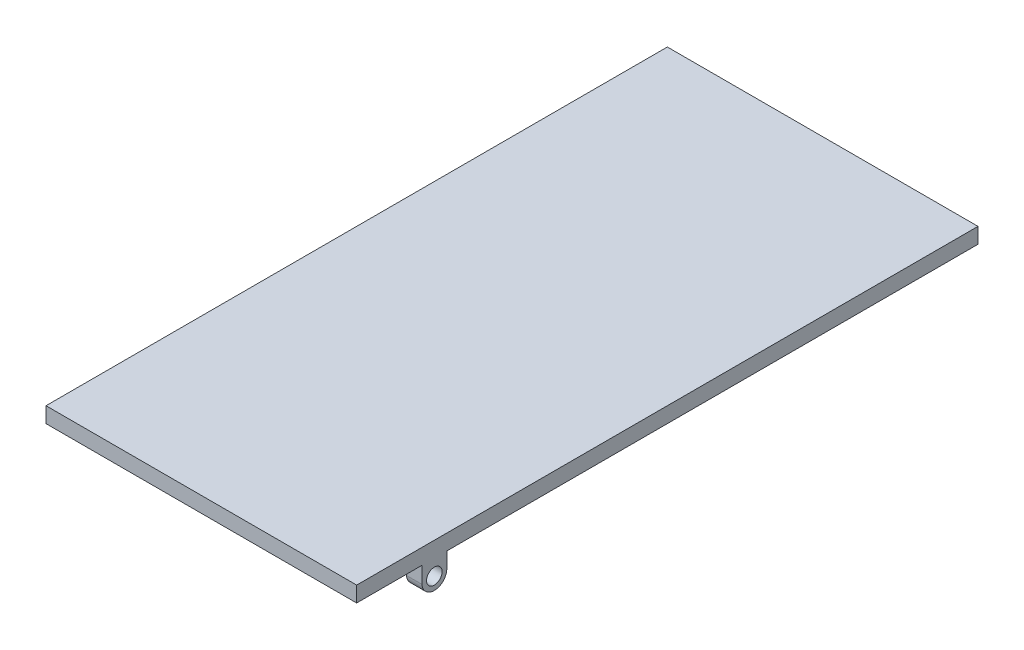
ISO-10303-21;
HEADER;
FILE_DESCRIPTION(('STEP AP214'),'2;1');
FILE_NAME('part.step','',(''),(''),'','','');
FILE_SCHEMA(('AUTOMOTIVE_DESIGN { 1 0 10303 214 1 1 1 1 }'));
ENDSEC;
DATA;
#1=APPLICATION_CONTEXT('core data for automotive mechanical design processes');
#2=APPLICATION_PROTOCOL_DEFINITION('international standard','automotive_design',2000,#1);
#3=PRODUCT_CONTEXT('',#1,'mechanical');
#4=PRODUCT('Part','Part','',(#3));
#5=PRODUCT_RELATED_PRODUCT_CATEGORY('part','',(#4));
#6=PRODUCT_DEFINITION_FORMATION('','',#4);
#7=PRODUCT_DEFINITION_CONTEXT('part definition',#1,'design');
#8=PRODUCT_DEFINITION('design','',#6,#7);
#9=PRODUCT_DEFINITION_SHAPE('','',#8);
#10=(LENGTH_UNIT() NAMED_UNIT(*) SI_UNIT(.MILLI.,.METRE.));
#11=(NAMED_UNIT(*) PLANE_ANGLE_UNIT() SI_UNIT($,.RADIAN.));
#12=(NAMED_UNIT(*) SI_UNIT($,.STERADIAN.) SOLID_ANGLE_UNIT());
#13=UNCERTAINTY_MEASURE_WITH_UNIT(LENGTH_MEASURE(1.E-05),#10,'distance_accuracy_value','');
#14=(GEOMETRIC_REPRESENTATION_CONTEXT(3) GLOBAL_UNCERTAINTY_ASSIGNED_CONTEXT((#13)) GLOBAL_UNIT_ASSIGNED_CONTEXT((#10,
#11,#12)) REPRESENTATION_CONTEXT('',''));
#15=CARTESIAN_POINT('',(0.,0.,0.));
#16=DIRECTION('',(0.,0.,1.));
#17=DIRECTION('',(1.,0.,0.));
#18=AXIS2_PLACEMENT_3D('',#15,#16,#17);
#19=CARTESIAN_POINT('',(0.,0.,342.));
#20=DIRECTION('',(0.,0.,1.));
#21=DIRECTION('',(1.,0.,0.));
#22=AXIS2_PLACEMENT_3D('',#19,#20,#21);
#23=PLANE('',#22);
#24=DIRECTION('',(0.,1.,0.));
#25=VECTOR('',#24,1.);
#26=CARTESIAN_POINT('',(10.,-75.,342.));
#27=LINE('',#26,#25);
#28=CARTESIAN_POINT('',(10.,-10.5969151687009,342.));
#29=VERTEX_POINT('',#28);
#30=CARTESIAN_POINT('',(10.,0.,342.));
#31=VERTEX_POINT('',#30);
#32=EDGE_CURVE('E125',#29,#31,#27,.T.);
#33=ORIENTED_EDGE('',*,*,#32,.F.);
#34=DIRECTION('',(1.,0.,0.));
#35=VECTOR('',#34,1.);
#36=CARTESIAN_POINT('',(0.,-10.5969151687009,342.));
#37=LINE('',#36,#35);
#38=CARTESIAN_POINT('',(0.,-10.5969151687009,342.));
#39=VERTEX_POINT('',#38);
#40=EDGE_CURVE('E169',#39,#29,#37,.T.);
#41=ORIENTED_EDGE('',*,*,#40,.F.);
#42=DIRECTION('',(0.,-1.,0.));
#43=VECTOR('',#42,1.);
#44=CARTESIAN_POINT('',(0.,0.,342.));
#45=LINE('',#44,#43);
#46=CARTESIAN_POINT('',(0.,0.,342.));
#47=VERTEX_POINT('',#46);
#48=EDGE_CURVE('E147',#47,#39,#45,.T.);
#49=ORIENTED_EDGE('',*,*,#48,.F.);
#50=DIRECTION('',(1.,0.,0.));
#51=VECTOR('',#50,1.);
#52=CARTESIAN_POINT('',(0.,0.,342.));
#53=LINE('',#52,#51);
#54=EDGE_CURVE('E143',#47,#31,#53,.T.);
#55=ORIENTED_EDGE('',*,*,#54,.T.);
#56=EDGE_LOOP('',(#33,#41,#49,#55));
#57=FACE_BOUND('',#56,.T.);
#58=ADVANCED_FACE('F35',(#57),#23,.F.);
#59=DIRECTION('',(0.,1.,0.));
#60=VECTOR('',#59,1.);
#61=CARTESIAN_POINT('',(190.,-75.,342.));
#62=LINE('',#61,#60);
#63=CARTESIAN_POINT('',(190.,-10.5969151687009,342.));
#64=VERTEX_POINT('',#63);
#65=CARTESIAN_POINT('',(190.,0.,342.));
#66=VERTEX_POINT('',#65);
#67=EDGE_CURVE('E138',#64,#66,#62,.T.);
#68=ORIENTED_EDGE('',*,*,#67,.T.);
#69=CARTESIAN_POINT('',(200.,0.,342.));
#70=VERTEX_POINT('',#69);
#71=EDGE_CURVE('E148',#66,#70,#53,.T.);
#72=ORIENTED_EDGE('',*,*,#71,.T.);
#73=DIRECTION('',(0.,-1.,0.));
#74=VECTOR('',#73,1.);
#75=CARTESIAN_POINT('',(200.,0.,342.));
#76=LINE('',#75,#74);
#77=CARTESIAN_POINT('',(200.,-10.5969151687009,342.));
#78=VERTEX_POINT('',#77);
#79=EDGE_CURVE('E209',#70,#78,#76,.T.);
#80=ORIENTED_EDGE('',*,*,#79,.T.);
#81=EDGE_CURVE('E217',#64,#78,#37,.T.);
#82=ORIENTED_EDGE('',*,*,#81,.F.);
#83=EDGE_LOOP('',(#68,#72,#80,#82));
#84=FACE_BOUND('',#83,.T.);
#85=ADVANCED_FACE('F235',(#84),#23,.F.);
#86=CARTESIAN_POINT('',(0.,-10.,350.));
#87=DIRECTION('',(1.,0.,0.));
#88=DIRECTION('',(0.,0.,-1.));
#89=AXIS2_PLACEMENT_3D('',#86,#87,#88);
#90=CYLINDRICAL_SURFACE('',#89,8.02223832347465);
#91=ORIENTED_EDGE('',*,*,#40,.T.);
#92=CARTESIAN_POINT('',(10.,-10.,350.));
#93=DIRECTION('',(1.,0.,0.));
#94=DIRECTION('',(0.,0.,-1.));
#95=AXIS2_PLACEMENT_3D('',#92,#93,#94);
#96=CIRCLE('',#95,8.02223832347465);
#97=CARTESIAN_POINT('',(10.,-10.5969151687009,358.));
#98=VERTEX_POINT('',#97);
#99=EDGE_CURVE('E132',#29,#98,#96,.F.);
#100=ORIENTED_EDGE('',*,*,#99,.T.);
#101=DIRECTION('',(1.,0.,0.));
#102=VECTOR('',#101,1.);
#103=CARTESIAN_POINT('',(0.,-10.5969151687009,358.));
#104=LINE('',#103,#102);
#105=CARTESIAN_POINT('',(0.,-10.5969151687009,358.));
#106=VERTEX_POINT('',#105);
#107=EDGE_CURVE('E218',#106,#98,#104,.T.);
#108=ORIENTED_EDGE('',*,*,#107,.F.);
#109=CARTESIAN_POINT('',(0.,-10.,350.));
#110=DIRECTION('',(1.,0.,0.));
#111=DIRECTION('',(0.,0.,-1.));
#112=AXIS2_PLACEMENT_3D('',#109,#110,#111);
#113=CIRCLE('',#112,8.02223832347465);
#114=EDGE_CURVE('E151',#106,#39,#113,.T.);
#115=ORIENTED_EDGE('',*,*,#114,.T.);
#116=EDGE_LOOP('',(#91,#100,#108,#115));
#117=FACE_BOUND('',#116,.T.);
#118=ADVANCED_FACE('F274',(#117),#90,.T.);
#119=CARTESIAN_POINT('',(190.,-10.5969151687009,358.));
#120=VERTEX_POINT('',#119);
#121=CARTESIAN_POINT('',(200.,-10.5969151687009,358.));
#122=VERTEX_POINT('',#121);
#123=EDGE_CURVE('E220',#120,#122,#104,.T.);
#124=ORIENTED_EDGE('',*,*,#123,.F.);
#125=CARTESIAN_POINT('',(190.,-10.,350.));
#126=DIRECTION('',(-1.,0.,0.));
#127=DIRECTION('',(0.,0.,1.));
#128=AXIS2_PLACEMENT_3D('',#125,#126,#127);
#129=CIRCLE('',#128,8.02223832347465);
#130=EDGE_CURVE('E184',#120,#64,#129,.F.);
#131=ORIENTED_EDGE('',*,*,#130,.T.);
#132=ORIENTED_EDGE('',*,*,#81,.T.);
#133=CARTESIAN_POINT('',(200.,-10.,350.));
#134=DIRECTION('',(1.,0.,0.));
#135=DIRECTION('',(0.,0.,-1.));
#136=AXIS2_PLACEMENT_3D('',#133,#134,#135);
#137=CIRCLE('',#136,8.02223832347465);
#138=EDGE_CURVE('E200',#122,#78,#137,.T.);
#139=ORIENTED_EDGE('',*,*,#138,.F.);
#140=EDGE_LOOP('',(#124,#131,#132,#139));
#141=FACE_BOUND('',#140,.T.);
#142=ADVANCED_FACE('F232',(#141),#90,.T.);
#143=CARTESIAN_POINT('',(0.,0.,358.));
#144=DIRECTION('',(0.,0.,1.));
#145=DIRECTION('',(1.,0.,0.));
#146=AXIS2_PLACEMENT_3D('',#143,#144,#145);
#147=PLANE('',#146);
#148=ORIENTED_EDGE('',*,*,#107,.T.);
#149=DIRECTION('',(0.,1.,0.));
#150=VECTOR('',#149,1.);
#151=CARTESIAN_POINT('',(10.,-75.,358.));
#152=LINE('',#151,#150);
#153=CARTESIAN_POINT('',(10.,0.,358.));
#154=VERTEX_POINT('',#153);
#155=EDGE_CURVE('E257',#98,#154,#152,.T.);
#156=ORIENTED_EDGE('',*,*,#155,.T.);
#157=DIRECTION('',(1.,0.,0.));
#158=VECTOR('',#157,1.);
#159=CARTESIAN_POINT('',(0.,0.,358.));
#160=LINE('',#159,#158);
#161=CARTESIAN_POINT('',(0.,0.,358.));
#162=VERTEX_POINT('',#161);
#163=EDGE_CURVE('E145',#162,#154,#160,.T.);
#164=ORIENTED_EDGE('',*,*,#163,.F.);
#165=DIRECTION('',(0.,-1.,0.));
#166=VECTOR('',#165,1.);
#167=CARTESIAN_POINT('',(0.,0.,358.));
#168=LINE('',#167,#166);
#169=EDGE_CURVE('E202',#162,#106,#168,.T.);
#170=ORIENTED_EDGE('',*,*,#169,.T.);
#171=EDGE_LOOP('',(#148,#156,#164,#170));
#172=FACE_BOUND('',#171,.T.);
#173=ADVANCED_FACE('F256',(#172),#147,.T.);
#174=CARTESIAN_POINT('',(190.,0.,358.));
#175=VERTEX_POINT('',#174);
#176=CARTESIAN_POINT('',(200.,0.,358.));
#177=VERTEX_POINT('',#176);
#178=EDGE_CURVE('E57',#175,#177,#160,.T.);
#179=ORIENTED_EDGE('',*,*,#178,.F.);
#180=DIRECTION('',(0.,1.,0.));
#181=VECTOR('',#180,1.);
#182=CARTESIAN_POINT('',(190.,-75.,358.));
#183=LINE('',#182,#181);
#184=EDGE_CURVE('E225',#120,#175,#183,.T.);
#185=ORIENTED_EDGE('',*,*,#184,.F.);
#186=ORIENTED_EDGE('',*,*,#123,.T.);
#187=DIRECTION('',(0.,-1.,0.));
#188=VECTOR('',#187,1.);
#189=CARTESIAN_POINT('',(200.,0.,358.));
#190=LINE('',#189,#188);
#191=EDGE_CURVE('E212',#177,#122,#190,.T.);
#192=ORIENTED_EDGE('',*,*,#191,.F.);
#193=EDGE_LOOP('',(#179,#185,#186,#192));
#194=FACE_BOUND('',#193,.T.);
#195=ADVANCED_FACE('F224',(#194),#147,.T.);
#196=CARTESIAN_POINT('',(0.,-10.,350.));
#197=DIRECTION('',(1.,0.,0.));
#198=DIRECTION('',(0.,0.,-1.));
#199=AXIS2_PLACEMENT_3D('',#196,#197,#198);
#200=CYLINDRICAL_SURFACE('',#199,4.99999999999999);
#201=CARTESIAN_POINT('',(0.,-10.,350.));
#202=DIRECTION('',(1.,0.,0.));
#203=DIRECTION('',(0.,0.,-1.));
#204=AXIS2_PLACEMENT_3D('',#201,#202,#203);
#205=CIRCLE('',#204,4.99999999999999);
#206=CARTESIAN_POINT('',(0.,-10.,345.));
#207=VERTEX_POINT('',#206);
#208=EDGE_CURVE('E197',#207,#207,#205,.T.);
#209=ORIENTED_EDGE('',*,*,#208,.F.);
#210=EDGE_LOOP('',(#209));
#211=FACE_BOUND('',#210,.T.);
#212=CARTESIAN_POINT('',(10.,-10.,350.));
#213=DIRECTION('',(1.,0.,0.));
#214=DIRECTION('',(0.,0.,-1.));
#215=AXIS2_PLACEMENT_3D('',#212,#213,#214);
#216=CIRCLE('',#215,4.99999999999999);
#217=CARTESIAN_POINT('',(10.,-10.,345.));
#218=VERTEX_POINT('',#217);
#219=EDGE_CURVE('E39',#218,#218,#216,.F.);
#220=ORIENTED_EDGE('',*,*,#219,.F.);
#221=EDGE_LOOP('',(#220));
#222=FACE_BOUND('',#221,.T.);
#223=ADVANCED_FACE('F278',(#211,#222),#200,.F.);
#224=CARTESIAN_POINT('',(200.,-10.,350.));
#225=DIRECTION('',(1.,0.,0.));
#226=DIRECTION('',(0.,0.,-1.));
#227=AXIS2_PLACEMENT_3D('',#224,#225,#226);
#228=CIRCLE('',#227,4.99999999999999);
#229=CARTESIAN_POINT('',(200.,-10.,345.));
#230=VERTEX_POINT('',#229);
#231=EDGE_CURVE('E196',#230,#230,#228,.T.);
#232=ORIENTED_EDGE('',*,*,#231,.T.);
#233=EDGE_LOOP('',(#232));
#234=FACE_BOUND('',#233,.T.);
#235=CARTESIAN_POINT('',(190.,-10.,350.));
#236=DIRECTION('',(-1.,0.,0.));
#237=DIRECTION('',(0.,0.,1.));
#238=AXIS2_PLACEMENT_3D('',#235,#236,#237);
#239=CIRCLE('',#238,4.99999999999999);
#240=CARTESIAN_POINT('',(190.,-10.,355.));
#241=VERTEX_POINT('',#240);
#242=EDGE_CURVE('E137',#241,#241,#239,.F.);
#243=ORIENTED_EDGE('',*,*,#242,.F.);
#244=EDGE_LOOP('',(#243));
#245=FACE_BOUND('',#244,.T.);
#246=ADVANCED_FACE('F281',(#234,#245),#200,.F.);
#247=CARTESIAN_POINT('',(0.,0.,400.));
#248=DIRECTION('',(1.,0.,0.));
#249=DIRECTION('',(0.,0.,-1.));
#250=AXIS2_PLACEMENT_3D('',#247,#248,#249);
#251=PLANE('',#250);
#252=DIRECTION('',(0.,-1.,0.));
#253=VECTOR('',#252,1.);
#254=CARTESIAN_POINT('',(0.,0.,0.));
#255=LINE('',#254,#253);
#256=CARTESIAN_POINT('',(0.,10.,0.));
#257=VERTEX_POINT('',#256);
#258=CARTESIAN_POINT('',(0.,0.,0.));
#259=VERTEX_POINT('',#258);
#260=EDGE_CURVE('E165',#257,#259,#255,.T.);
#261=ORIENTED_EDGE('',*,*,#260,.T.);
#262=DIRECTION('',(0.,0.,-1.));
#263=VECTOR('',#262,1.);
#264=CARTESIAN_POINT('',(0.,0.,400.));
#265=LINE('',#264,#263);
#266=EDGE_CURVE('E44',#47,#259,#265,.T.);
#267=ORIENTED_EDGE('',*,*,#266,.F.);
#268=ORIENTED_EDGE('',*,*,#48,.T.);
#269=ORIENTED_EDGE('',*,*,#114,.F.);
#270=ORIENTED_EDGE('',*,*,#169,.F.);
#271=CARTESIAN_POINT('',(0.,0.,400.));
#272=VERTEX_POINT('',#271);
#273=EDGE_CURVE('E11',#272,#162,#265,.T.);
#274=ORIENTED_EDGE('',*,*,#273,.F.);
#275=DIRECTION('',(0.,-1.,0.));
#276=VECTOR('',#275,1.);
#277=CARTESIAN_POINT('',(0.,0.,400.));
#278=LINE('',#277,#276);
#279=CARTESIAN_POINT('',(0.,10.,400.));
#280=VERTEX_POINT('',#279);
#281=EDGE_CURVE('E154',#280,#272,#278,.T.);
#282=ORIENTED_EDGE('',*,*,#281,.F.);
#283=DIRECTION('',(0.,0.,-1.));
#284=VECTOR('',#283,1.);
#285=CARTESIAN_POINT('',(0.,10.,400.));
#286=LINE('',#285,#284);
#287=EDGE_CURVE('E164',#280,#257,#286,.T.);
#288=ORIENTED_EDGE('',*,*,#287,.T.);
#289=EDGE_LOOP('',(#261,#267,#268,#269,#270,#274,#282,#288));
#290=FACE_BOUND('',#289,.T.);
#291=ORIENTED_EDGE('',*,*,#208,.T.);
#292=EDGE_LOOP('',(#291));
#293=FACE_BOUND('',#292,.T.);
#294=ADVANCED_FACE('F37',(#290,#293),#251,.F.);
#295=CARTESIAN_POINT('',(0.,0.,400.));
#296=DIRECTION('',(0.,1.,0.));
#297=DIRECTION('',(0.,0.,1.));
#298=AXIS2_PLACEMENT_3D('',#295,#296,#297);
#299=PLANE('',#298);
#300=ORIENTED_EDGE('',*,*,#273,.T.);
#301=ORIENTED_EDGE('',*,*,#163,.T.);
#302=DIRECTION('',(0.,0.,-1.));
#303=VECTOR('',#302,1.);
#304=CARTESIAN_POINT('',(10.,0.,358.));
#305=LINE('',#304,#303);
#306=EDGE_CURVE('E129',#154,#31,#305,.T.);
#307=ORIENTED_EDGE('',*,*,#306,.T.);
#308=ORIENTED_EDGE('',*,*,#54,.F.);
#309=ORIENTED_EDGE('',*,*,#266,.T.);
#310=DIRECTION('',(1.,0.,0.));
#311=VECTOR('',#310,1.);
#312=CARTESIAN_POINT('',(0.,0.,0.));
#313=LINE('',#312,#311);
#314=CARTESIAN_POINT('',(200.,0.,0.));
#315=VERTEX_POINT('',#314);
#316=EDGE_CURVE('E168',#259,#315,#313,.T.);
#317=ORIENTED_EDGE('',*,*,#316,.T.);
#318=DIRECTION('',(0.,0.,-1.));
#319=VECTOR('',#318,1.);
#320=CARTESIAN_POINT('',(200.,0.,400.));
#321=LINE('',#320,#319);
#322=EDGE_CURVE('E180',#70,#315,#321,.T.);
#323=ORIENTED_EDGE('',*,*,#322,.F.);
#324=ORIENTED_EDGE('',*,*,#71,.F.);
#325=DIRECTION('',(0.,0.,1.));
#326=VECTOR('',#325,1.);
#327=CARTESIAN_POINT('',(190.,0.,358.));
#328=LINE('',#327,#326);
#329=EDGE_CURVE('E52',#66,#175,#328,.T.);
#330=ORIENTED_EDGE('',*,*,#329,.T.);
#331=ORIENTED_EDGE('',*,*,#178,.T.);
#332=CARTESIAN_POINT('',(200.,0.,400.));
#333=VERTEX_POINT('',#332);
#334=EDGE_CURVE('E181',#333,#177,#321,.T.);
#335=ORIENTED_EDGE('',*,*,#334,.F.);
#336=DIRECTION('',(1.,0.,0.));
#337=VECTOR('',#336,1.);
#338=CARTESIAN_POINT('',(0.,0.,400.));
#339=LINE('',#338,#337);
#340=EDGE_CURVE('E157',#272,#333,#339,.T.);
#341=ORIENTED_EDGE('',*,*,#340,.F.);
#342=EDGE_LOOP('',(#300,#301,#307,#308,#309,#317,#323,#324,#330,#331,#335,#341));
#343=FACE_BOUND('',#342,.T.);
#344=ADVANCED_FACE('F142',(#343),#299,.F.);
#345=CARTESIAN_POINT('',(200.,0.,400.));
#346=DIRECTION('',(-1.,0.,0.));
#347=DIRECTION('',(0.,0.,1.));
#348=AXIS2_PLACEMENT_3D('',#345,#346,#347);
#349=PLANE('',#348);
#350=DIRECTION('',(0.,1.,0.));
#351=VECTOR('',#350,1.);
#352=CARTESIAN_POINT('',(200.,0.,0.));
#353=LINE('',#352,#351);
#354=CARTESIAN_POINT('',(200.,10.,0.));
#355=VERTEX_POINT('',#354);
#356=EDGE_CURVE('E172',#315,#355,#353,.T.);
#357=ORIENTED_EDGE('',*,*,#356,.T.);
#358=DIRECTION('',(0.,0.,-1.));
#359=VECTOR('',#358,1.);
#360=CARTESIAN_POINT('',(200.,10.,400.));
#361=LINE('',#360,#359);
#362=CARTESIAN_POINT('',(200.,10.,400.));
#363=VERTEX_POINT('',#362);
#364=EDGE_CURVE('E177',#363,#355,#361,.T.);
#365=ORIENTED_EDGE('',*,*,#364,.F.);
#366=DIRECTION('',(0.,1.,0.));
#367=VECTOR('',#366,1.);
#368=CARTESIAN_POINT('',(200.,0.,400.));
#369=LINE('',#368,#367);
#370=EDGE_CURVE('E160',#333,#363,#369,.T.);
#371=ORIENTED_EDGE('',*,*,#370,.F.);
#372=ORIENTED_EDGE('',*,*,#334,.T.);
#373=ORIENTED_EDGE('',*,*,#191,.T.);
#374=ORIENTED_EDGE('',*,*,#138,.T.);
#375=ORIENTED_EDGE('',*,*,#79,.F.);
#376=ORIENTED_EDGE('',*,*,#322,.T.);
#377=EDGE_LOOP('',(#357,#365,#371,#372,#373,#374,#375,#376));
#378=FACE_BOUND('',#377,.T.);
#379=ORIENTED_EDGE('',*,*,#231,.F.);
#380=EDGE_LOOP('',(#379));
#381=FACE_BOUND('',#380,.T.);
#382=ADVANCED_FACE('F228',(#378,#381),#349,.F.);
#383=CARTESIAN_POINT('',(0.,10.,400.));
#384=DIRECTION('',(0.,-1.,0.));
#385=DIRECTION('',(0.,0.,-1.));
#386=AXIS2_PLACEMENT_3D('',#383,#384,#385);
#387=PLANE('',#386);
#388=DIRECTION('',(-1.,0.,0.));
#389=VECTOR('',#388,1.);
#390=CARTESIAN_POINT('',(0.,10.,0.));
#391=LINE('',#390,#389);
#392=EDGE_CURVE('E158',#355,#257,#391,.T.);
#393=ORIENTED_EDGE('',*,*,#392,.T.);
#394=ORIENTED_EDGE('',*,*,#287,.F.);
#395=DIRECTION('',(-1.,0.,0.));
#396=VECTOR('',#395,1.);
#397=CARTESIAN_POINT('',(0.,10.,400.));
#398=LINE('',#397,#396);
#399=EDGE_CURVE('E162',#363,#280,#398,.T.);
#400=ORIENTED_EDGE('',*,*,#399,.F.);
#401=ORIENTED_EDGE('',*,*,#364,.T.);
#402=EDGE_LOOP('',(#393,#394,#400,#401));
#403=FACE_BOUND('',#402,.T.);
#404=ADVANCED_FACE('F246',(#403),#387,.F.);
#405=CARTESIAN_POINT('',(0.,0.,400.));
#406=DIRECTION('',(0.,0.,-1.));
#407=DIRECTION('',(-1.,0.,0.));
#408=AXIS2_PLACEMENT_3D('',#405,#406,#407);
#409=PLANE('',#408);
#410=ORIENTED_EDGE('',*,*,#281,.T.);
#411=ORIENTED_EDGE('',*,*,#340,.T.);
#412=ORIENTED_EDGE('',*,*,#370,.T.);
#413=ORIENTED_EDGE('',*,*,#399,.T.);
#414=EDGE_LOOP('',(#410,#411,#412,#413));
#415=FACE_BOUND('',#414,.T.);
#416=ADVANCED_FACE('F250',(#415),#409,.F.);
#417=CARTESIAN_POINT('',(0.,0.,0.));
#418=DIRECTION('',(0.,0.,-1.));
#419=DIRECTION('',(-1.,0.,0.));
#420=AXIS2_PLACEMENT_3D('',#417,#418,#419);
#421=PLANE('',#420);
#422=ORIENTED_EDGE('',*,*,#260,.F.);
#423=ORIENTED_EDGE('',*,*,#392,.F.);
#424=ORIENTED_EDGE('',*,*,#356,.F.);
#425=ORIENTED_EDGE('',*,*,#316,.F.);
#426=EDGE_LOOP('',(#422,#423,#424,#425));
#427=FACE_BOUND('',#426,.T.);
#428=ADVANCED_FACE('F242',(#427),#421,.T.);
#429=CARTESIAN_POINT('',(10.,-75.,358.));
#430=DIRECTION('',(1.,0.,0.));
#431=DIRECTION('',(0.,0.,-1.));
#432=AXIS2_PLACEMENT_3D('',#429,#430,#431);
#433=PLANE('',#432);
#434=ORIENTED_EDGE('',*,*,#32,.T.);
#435=ORIENTED_EDGE('',*,*,#306,.F.);
#436=ORIENTED_EDGE('',*,*,#155,.F.);
#437=ORIENTED_EDGE('',*,*,#99,.F.);
#438=EDGE_LOOP('',(#434,#435,#436,#437));
#439=FACE_BOUND('',#438,.T.);
#440=ORIENTED_EDGE('',*,*,#219,.T.);
#441=EDGE_LOOP('',(#440));
#442=FACE_BOUND('',#441,.T.);
#443=ADVANCED_FACE('F127',(#439,#442),#433,.T.);
#444=CARTESIAN_POINT('',(190.,-75.,358.));
#445=DIRECTION('',(-1.,0.,0.));
#446=DIRECTION('',(0.,0.,1.));
#447=AXIS2_PLACEMENT_3D('',#444,#445,#446);
#448=PLANE('',#447);
#449=ORIENTED_EDGE('',*,*,#184,.T.);
#450=ORIENTED_EDGE('',*,*,#329,.F.);
#451=ORIENTED_EDGE('',*,*,#67,.F.);
#452=ORIENTED_EDGE('',*,*,#130,.F.);
#453=EDGE_LOOP('',(#449,#450,#451,#452));
#454=FACE_BOUND('',#453,.T.);
#455=ORIENTED_EDGE('',*,*,#242,.T.);
#456=EDGE_LOOP('',(#455));
#457=FACE_BOUND('',#456,.T.);
#458=ADVANCED_FACE('F262',(#454,#457),#448,.T.);
#459=CLOSED_SHELL('',(#58,#85,#118,#142,#173,#195,#223,#246,#294,#344,#382,#404,#416,#428,#443,#458));
#460=MANIFOLD_SOLID_BREP('B2',#459);
#461=ADVANCED_BREP_SHAPE_REPRESENTATION('',(#18,#460),#14);
#462=SHAPE_DEFINITION_REPRESENTATION(#9,#461);
ENDSEC;
END-ISO-10303-21;
